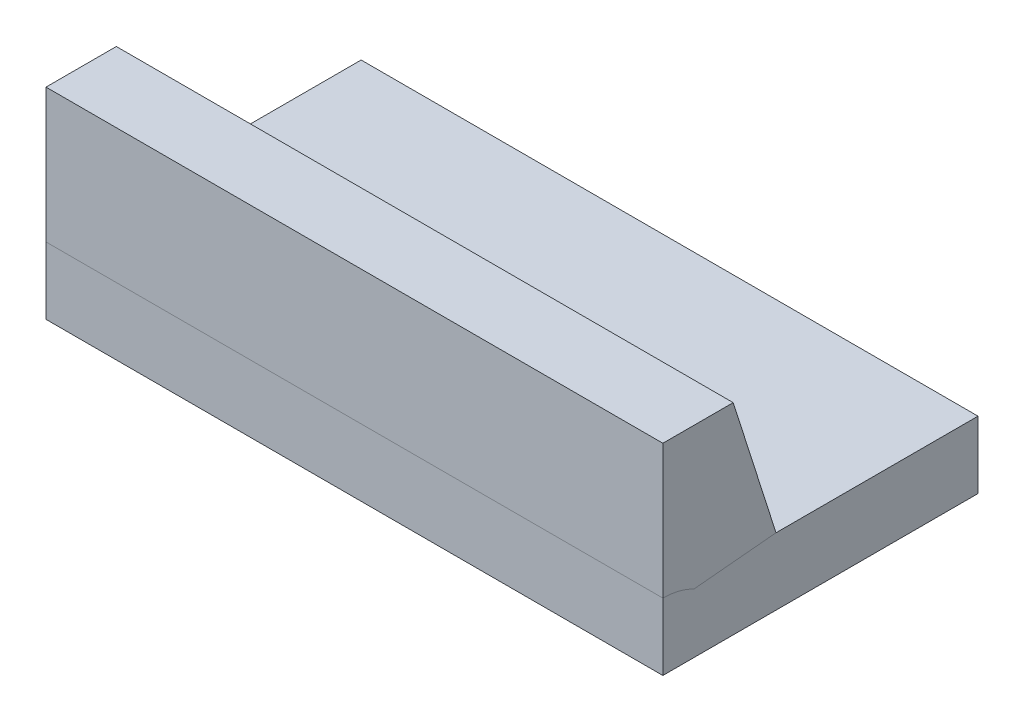
ISO-10303-21;
HEADER;
FILE_DESCRIPTION(('STEP AP214'),'2;1');
FILE_NAME('part.step','',(''),(''),'','','');
FILE_SCHEMA(('AUTOMOTIVE_DESIGN { 1 0 10303 214 1 1 1 1 }'));
ENDSEC;
DATA;
#1=APPLICATION_CONTEXT('core data for automotive mechanical design processes');
#2=APPLICATION_PROTOCOL_DEFINITION('international standard','automotive_design',2000,#1);
#3=PRODUCT_CONTEXT('',#1,'mechanical');
#4=PRODUCT('Part','Part','',(#3));
#5=PRODUCT_RELATED_PRODUCT_CATEGORY('part','',(#4));
#6=PRODUCT_DEFINITION_FORMATION('','',#4);
#7=PRODUCT_DEFINITION_CONTEXT('part definition',#1,'design');
#8=PRODUCT_DEFINITION('design','',#6,#7);
#9=PRODUCT_DEFINITION_SHAPE('','',#8);
#10=(LENGTH_UNIT() NAMED_UNIT(*) SI_UNIT(.MILLI.,.METRE.));
#11=(NAMED_UNIT(*) PLANE_ANGLE_UNIT() SI_UNIT($,.RADIAN.));
#12=(NAMED_UNIT(*) SI_UNIT($,.STERADIAN.) SOLID_ANGLE_UNIT());
#13=UNCERTAINTY_MEASURE_WITH_UNIT(LENGTH_MEASURE(1.E-05),#10,'distance_accuracy_value','');
#14=(GEOMETRIC_REPRESENTATION_CONTEXT(3) GLOBAL_UNCERTAINTY_ASSIGNED_CONTEXT((#13)) GLOBAL_UNIT_ASSIGNED_CONTEXT((#10,
#11,#12)) REPRESENTATION_CONTEXT('',''));
#15=CARTESIAN_POINT('',(0.,0.,0.));
#16=DIRECTION('',(0.,0.,1.));
#17=DIRECTION('',(1.,0.,0.));
#18=AXIS2_PLACEMENT_3D('',#15,#16,#17);
#19=CARTESIAN_POINT('',(22.0736196319018,15.,0.332030832005614));
#20=DIRECTION('',(1.,0.,0.));
#21=DIRECTION('',(0.,0.,-1.));
#22=AXIS2_PLACEMENT_3D('',#19,#20,#21);
#23=PLANE('',#22);
#24=DIRECTION('',(0.,0.,-1.));
#25=VECTOR('',#24,1.);
#26=CARTESIAN_POINT('',(22.0736196319018,5.,-12.7300613496932));
#27=LINE('',#26,#25);
#28=CARTESIAN_POINT('',(22.0736196319018,5.,2.33203083200561));
#29=VERTEX_POINT('',#28);
#30=CARTESIAN_POINT('',(22.0736196319018,5.,-12.7300613496932));
#31=VERTEX_POINT('',#30);
#32=EDGE_CURVE('E158',#29,#31,#27,.T.);
#33=ORIENTED_EDGE('',*,*,#32,.F.);
#34=DIRECTION('',(0.,-0.952604427614458,-0.3042117757243));
#35=VECTOR('',#34,1.);
#36=CARTESIAN_POINT('',(22.0736196319018,5.,2.33203083200561));
#37=LINE('',#36,#35);
#38=CARTESIAN_POINT('',(22.0736196319018,15.,5.52550513157523));
#39=VERTEX_POINT('',#38);
#40=EDGE_CURVE('E115',#39,#29,#37,.T.);
#41=ORIENTED_EDGE('',*,*,#40,.F.);
#42=DIRECTION('',(0.,0.,1.));
#43=VECTOR('',#42,1.);
#44=CARTESIAN_POINT('',(22.0736196319018,15.,0.332030832005614));
#45=LINE('',#44,#43);
#46=CARTESIAN_POINT('',(22.0736196319018,15.,10.7699386503067));
#47=VERTEX_POINT('',#46);
#48=EDGE_CURVE('E119',#39,#47,#45,.T.);
#49=ORIENTED_EDGE('',*,*,#48,.T.);
#50=DIRECTION('',(0.,-1.,0.));
#51=VECTOR('',#50,1.);
#52=CARTESIAN_POINT('',(22.0736196319018,15.,10.7699386503067));
#53=LINE('',#52,#51);
#54=CARTESIAN_POINT('',(22.0736196319018,5.,10.7699386503067));
#55=VERTEX_POINT('',#54);
#56=EDGE_CURVE('E124',#47,#55,#53,.T.);
#57=ORIENTED_EDGE('',*,*,#56,.T.);
#58=CARTESIAN_POINT('',(22.0736196319018,0.,10.7699386503068));
#59=DIRECTION('',(1.,0.,0.));
#60=DIRECTION('',(0.,0.,-1.));
#61=AXIS2_PLACEMENT_3D('',#58,#59,#60);
#62=CIRCLE('',#61,5.);
#63=CARTESIAN_POINT('',(22.0736196319018,0.,5.76993865030675));
#64=VERTEX_POINT('',#63);
#65=EDGE_CURVE('E138',#64,#55,#62,.T.);
#66=ORIENTED_EDGE('',*,*,#65,.F.);
#67=DIRECTION('',(0.,0.,-1.));
#68=VECTOR('',#67,1.);
#69=CARTESIAN_POINT('',(22.0736196319018,0.,-12.7300613496932));
#70=LINE('',#69,#68);
#71=CARTESIAN_POINT('',(22.0736196319018,0.,-12.7300613496932));
#72=VERTEX_POINT('',#71);
#73=EDGE_CURVE('E151',#64,#72,#70,.T.);
#74=ORIENTED_EDGE('',*,*,#73,.T.);
#75=DIRECTION('',(0.,-1.,0.));
#76=VECTOR('',#75,1.);
#77=CARTESIAN_POINT('',(22.0736196319018,5.,-12.7300613496932));
#78=LINE('',#77,#76);
#79=EDGE_CURVE('E140',#31,#72,#78,.T.);
#80=ORIENTED_EDGE('',*,*,#79,.F.);
#81=EDGE_LOOP('',(#33,#41,#49,#57,#66,#74,#80));
#82=FACE_BOUND('',#81,.T.);
#83=ADVANCED_FACE('F47',(#82),#23,.T.);
#84=CARTESIAN_POINT('',(-23.9263803680982,15.,0.332030832005614));
#85=DIRECTION('',(1.,0.,0.));
#86=DIRECTION('',(0.,0.,-1.));
#87=AXIS2_PLACEMENT_3D('',#84,#85,#86);
#88=PLANE('',#87);
#89=DIRECTION('',(0.,-0.952604427614458,-0.3042117757243));
#90=VECTOR('',#89,1.);
#91=CARTESIAN_POINT('',(-23.9263803680982,5.,2.33203083200563));
#92=LINE('',#91,#90);
#93=CARTESIAN_POINT('',(-23.9263803680982,15.,5.52550513157525));
#94=VERTEX_POINT('',#93);
#95=CARTESIAN_POINT('',(-23.9263803680982,5.,2.33203083200563));
#96=VERTEX_POINT('',#95);
#97=EDGE_CURVE('E106',#94,#96,#92,.T.);
#98=ORIENTED_EDGE('',*,*,#97,.T.);
#99=DIRECTION('',(0.,0.,1.));
#100=VECTOR('',#99,1.);
#101=CARTESIAN_POINT('',(-23.9263803680982,5.,-12.7300613496932));
#102=LINE('',#101,#100);
#103=CARTESIAN_POINT('',(-23.9263803680982,5.,-12.7300613496932));
#104=VERTEX_POINT('',#103);
#105=EDGE_CURVE('E150',#104,#96,#102,.T.);
#106=ORIENTED_EDGE('',*,*,#105,.F.);
#107=DIRECTION('',(0.,-1.,0.));
#108=VECTOR('',#107,1.);
#109=CARTESIAN_POINT('',(-23.9263803680982,5.,-12.7300613496932));
#110=LINE('',#109,#108);
#111=CARTESIAN_POINT('',(-23.9263803680982,0.,-12.7300613496932));
#112=VERTEX_POINT('',#111);
#113=EDGE_CURVE('E142',#104,#112,#110,.T.);
#114=ORIENTED_EDGE('',*,*,#113,.T.);
#115=DIRECTION('',(0.,0.,1.));
#116=VECTOR('',#115,1.);
#117=CARTESIAN_POINT('',(-23.9263803680982,0.,-12.7300613496932));
#118=LINE('',#117,#116);
#119=CARTESIAN_POINT('',(-23.9263803680982,0.,5.76993865030677));
#120=VERTEX_POINT('',#119);
#121=EDGE_CURVE('E153',#112,#120,#118,.T.);
#122=ORIENTED_EDGE('',*,*,#121,.T.);
#123=CARTESIAN_POINT('',(-23.9263803680982,0.,10.7699386503068));
#124=DIRECTION('',(1.,0.,0.));
#125=DIRECTION('',(0.,0.,-1.));
#126=AXIS2_PLACEMENT_3D('',#123,#124,#125);
#127=CIRCLE('',#126,5.);
#128=CARTESIAN_POINT('',(-23.9263803680982,5.,10.7699386503068));
#129=VERTEX_POINT('',#128);
#130=EDGE_CURVE('E61',#120,#129,#127,.T.);
#131=ORIENTED_EDGE('',*,*,#130,.T.);
#132=DIRECTION('',(0.,-1.,0.));
#133=VECTOR('',#132,1.);
#134=CARTESIAN_POINT('',(-23.9263803680982,15.,10.7699386503068));
#135=LINE('',#134,#133);
#136=CARTESIAN_POINT('',(-23.9263803680982,15.,10.7699386503068));
#137=VERTEX_POINT('',#136);
#138=EDGE_CURVE('E54',#137,#129,#135,.T.);
#139=ORIENTED_EDGE('',*,*,#138,.F.);
#140=DIRECTION('',(0.,0.,1.));
#141=VECTOR('',#140,1.);
#142=CARTESIAN_POINT('',(-23.9263803680982,15.,0.332030832005614));
#143=LINE('',#142,#141);
#144=EDGE_CURVE('E68',#94,#137,#143,.T.);
#145=ORIENTED_EDGE('',*,*,#144,.F.);
#146=EDGE_LOOP('',(#98,#106,#114,#122,#131,#139,#145));
#147=FACE_BOUND('',#146,.T.);
#148=ADVANCED_FACE('F121',(#147),#88,.F.);
#149=CARTESIAN_POINT('',(22.0736196319018,15.,10.7699386503067));
#150=DIRECTION('',(0.,0.,1.));
#151=DIRECTION('',(1.,0.,0.));
#152=AXIS2_PLACEMENT_3D('',#149,#150,#151);
#153=PLANE('',#152);
#154=DIRECTION('',(1.,0.,0.));
#155=VECTOR('',#154,1.);
#156=CARTESIAN_POINT('',(-23.9263803680982,5.,10.7699386503068));
#157=LINE('',#156,#155);
#158=EDGE_CURVE('E135',#55,#129,#157,.F.);
#159=ORIENTED_EDGE('',*,*,#158,.F.);
#160=ORIENTED_EDGE('',*,*,#56,.F.);
#161=DIRECTION('',(-1.,0.,0.));
#162=VECTOR('',#161,1.);
#163=CARTESIAN_POINT('',(22.0736196319018,15.,10.7699386503067));
#164=LINE('',#163,#162);
#165=EDGE_CURVE('E125',#47,#137,#164,.T.);
#166=ORIENTED_EDGE('',*,*,#165,.T.);
#167=ORIENTED_EDGE('',*,*,#138,.T.);
#168=EDGE_LOOP('',(#159,#160,#166,#167));
#169=FACE_BOUND('',#168,.T.);
#170=ADVANCED_FACE('F133',(#169),#153,.T.);
#171=CARTESIAN_POINT('',(0.,15.,0.));
#172=DIRECTION('',(0.,-1.,0.));
#173=DIRECTION('',(0.,0.,-1.));
#174=AXIS2_PLACEMENT_3D('',#171,#172,#173);
#175=PLANE('',#174);
#176=ORIENTED_EDGE('',*,*,#48,.F.);
#177=DIRECTION('',(1.,0.,0.));
#178=VECTOR('',#177,1.);
#179=CARTESIAN_POINT('',(-23.9263803680982,15.,5.52550513157525));
#180=LINE('',#179,#178);
#181=EDGE_CURVE('E109',#94,#39,#180,.T.);
#182=ORIENTED_EDGE('',*,*,#181,.F.);
#183=ORIENTED_EDGE('',*,*,#144,.T.);
#184=ORIENTED_EDGE('',*,*,#165,.F.);
#185=EDGE_LOOP('',(#176,#182,#183,#184));
#186=FACE_BOUND('',#185,.T.);
#187=ADVANCED_FACE('F118',(#186),#175,.F.);
#188=CARTESIAN_POINT('',(0.,5.,0.));
#189=DIRECTION('',(0.,1.,0.));
#190=DIRECTION('',(0.,0.,1.));
#191=AXIS2_PLACEMENT_3D('',#188,#189,#190);
#192=PLANE('',#191);
#193=CARTESIAN_POINT('',(10.0239592700189,5.,-4.31196916445347));
#194=DIRECTION('',(0.,1.,0.));
#195=DIRECTION('',(0.,0.,1.));
#196=AXIS2_PLACEMENT_3D('',#193,#194,#195);
#197=CIRCLE('',#196,2.);
#198=CARTESIAN_POINT('',(10.0239592700189,5.,-2.31196916445347));
#199=VERTEX_POINT('',#198);
#200=EDGE_CURVE('E156',#199,#199,#197,.T.);
#201=ORIENTED_EDGE('',*,*,#200,.F.);
#202=EDGE_LOOP('',(#201));
#203=FACE_BOUND('',#202,.T.);
#204=CARTESIAN_POINT('',(-11.9754119645762,5.,-4.4780632943706));
#205=DIRECTION('',(0.,1.,0.));
#206=DIRECTION('',(0.,0.,1.));
#207=AXIS2_PLACEMENT_3D('',#204,#205,#206);
#208=CIRCLE('',#207,2.00000000000001);
#209=CARTESIAN_POINT('',(-11.9754119645762,5.,-2.47806329437059));
#210=VERTEX_POINT('',#209);
#211=EDGE_CURVE('E163',#210,#210,#208,.T.);
#212=ORIENTED_EDGE('',*,*,#211,.F.);
#213=EDGE_LOOP('',(#212));
#214=FACE_BOUND('',#213,.T.);
#215=ORIENTED_EDGE('',*,*,#105,.T.);
#216=DIRECTION('',(1.,0.,0.));
#217=VECTOR('',#216,1.);
#218=CARTESIAN_POINT('',(-23.9263803680982,5.,2.33203083200563));
#219=LINE('',#218,#217);
#220=EDGE_CURVE('E112',#96,#29,#219,.T.);
#221=ORIENTED_EDGE('',*,*,#220,.T.);
#222=ORIENTED_EDGE('',*,*,#32,.T.);
#223=DIRECTION('',(-1.,0.,0.));
#224=VECTOR('',#223,1.);
#225=CARTESIAN_POINT('',(-23.9263803680982,5.,-12.7300613496932));
#226=LINE('',#225,#224);
#227=EDGE_CURVE('E147',#31,#104,#226,.T.);
#228=ORIENTED_EDGE('',*,*,#227,.T.);
#229=EDGE_LOOP('',(#215,#221,#222,#228));
#230=FACE_BOUND('',#229,.T.);
#231=ADVANCED_FACE('F177',(#203,#214,#230),#192,.T.);
#232=CARTESIAN_POINT('',(-23.9263803680982,5.,-12.7300613496932));
#233=DIRECTION('',(0.,0.,1.));
#234=DIRECTION('',(1.,0.,0.));
#235=AXIS2_PLACEMENT_3D('',#232,#233,#234);
#236=PLANE('',#235);
#237=DIRECTION('',(-1.,0.,0.));
#238=VECTOR('',#237,1.);
#239=CARTESIAN_POINT('',(-23.9263803680982,0.,-12.7300613496932));
#240=LINE('',#239,#238);
#241=EDGE_CURVE('E148',#72,#112,#240,.T.);
#242=ORIENTED_EDGE('',*,*,#241,.T.);
#243=ORIENTED_EDGE('',*,*,#113,.F.);
#244=ORIENTED_EDGE('',*,*,#227,.F.);
#245=ORIENTED_EDGE('',*,*,#79,.T.);
#246=EDGE_LOOP('',(#242,#243,#244,#245));
#247=FACE_BOUND('',#246,.T.);
#248=ADVANCED_FACE('F210',(#247),#236,.F.);
#249=CARTESIAN_POINT('',(0.,0.,0.));
#250=DIRECTION('',(0.,1.,0.));
#251=DIRECTION('',(0.,0.,1.));
#252=AXIS2_PLACEMENT_3D('',#249,#250,#251);
#253=PLANE('',#252);
#254=CARTESIAN_POINT('',(10.0239592700189,0.,-4.31196916445347));
#255=DIRECTION('',(0.,-1.,0.));
#256=DIRECTION('',(0.,0.,-1.));
#257=AXIS2_PLACEMENT_3D('',#254,#255,#256);
#258=CIRCLE('',#257,2.);
#259=CARTESIAN_POINT('',(10.0239592700189,0.,-6.31196916445347));
#260=VERTEX_POINT('',#259);
#261=EDGE_CURVE('E166',#260,#260,#258,.T.);
#262=ORIENTED_EDGE('',*,*,#261,.F.);
#263=EDGE_LOOP('',(#262));
#264=FACE_BOUND('',#263,.T.);
#265=CARTESIAN_POINT('',(-11.9754119645762,0.,-4.4780632943706));
#266=DIRECTION('',(0.,-1.,0.));
#267=DIRECTION('',(0.,0.,-1.));
#268=AXIS2_PLACEMENT_3D('',#265,#266,#267);
#269=CIRCLE('',#268,2.00000000000001);
#270=CARTESIAN_POINT('',(-11.9754119645762,0.,-6.4780632943706));
#271=VERTEX_POINT('',#270);
#272=EDGE_CURVE('E167',#271,#271,#269,.T.);
#273=ORIENTED_EDGE('',*,*,#272,.F.);
#274=EDGE_LOOP('',(#273));
#275=FACE_BOUND('',#274,.T.);
#276=ORIENTED_EDGE('',*,*,#73,.F.);
#277=DIRECTION('',(1.,0.,0.));
#278=VECTOR('',#277,1.);
#279=CARTESIAN_POINT('',(-23.9263803680982,0.,5.76993865030677));
#280=LINE('',#279,#278);
#281=EDGE_CURVE('E12',#64,#120,#280,.F.);
#282=ORIENTED_EDGE('',*,*,#281,.T.);
#283=ORIENTED_EDGE('',*,*,#121,.F.);
#284=ORIENTED_EDGE('',*,*,#241,.F.);
#285=EDGE_LOOP('',(#276,#282,#283,#284));
#286=FACE_BOUND('',#285,.T.);
#287=ADVANCED_FACE('F185',(#264,#275,#286),#253,.F.);
#288=CARTESIAN_POINT('',(-11.9754119645762,10.,-4.4780632943706));
#289=DIRECTION('',(0.,-1.,0.));
#290=DIRECTION('',(0.,0.,-1.));
#291=AXIS2_PLACEMENT_3D('',#288,#289,#290);
#292=CYLINDRICAL_SURFACE('',#291,2.00000000000001);
#293=ORIENTED_EDGE('',*,*,#211,.T.);
#294=EDGE_LOOP('',(#293));
#295=FACE_BOUND('',#294,.T.);
#296=ORIENTED_EDGE('',*,*,#272,.T.);
#297=EDGE_LOOP('',(#296));
#298=FACE_BOUND('',#297,.T.);
#299=ADVANCED_FACE('F195',(#295,#298),#292,.F.);
#300=CARTESIAN_POINT('',(10.0239592700189,10.,-4.31196916445347));
#301=DIRECTION('',(0.,-1.,0.));
#302=DIRECTION('',(0.,0.,-1.));
#303=AXIS2_PLACEMENT_3D('',#300,#301,#302);
#304=CYLINDRICAL_SURFACE('',#303,2.);
#305=ORIENTED_EDGE('',*,*,#200,.T.);
#306=EDGE_LOOP('',(#305));
#307=FACE_BOUND('',#306,.T.);
#308=ORIENTED_EDGE('',*,*,#261,.T.);
#309=EDGE_LOOP('',(#308));
#310=FACE_BOUND('',#309,.T.);
#311=ADVANCED_FACE('F188',(#307,#310),#304,.F.);
#312=CARTESIAN_POINT('',(-23.9263803680982,0.,10.7699386503068));
#313=DIRECTION('',(1.,0.,0.));
#314=DIRECTION('',(0.,0.,-1.));
#315=AXIS2_PLACEMENT_3D('',#312,#313,#314);
#316=CYLINDRICAL_SURFACE('',#315,5.);
#317=ORIENTED_EDGE('',*,*,#158,.T.);
#318=ORIENTED_EDGE('',*,*,#130,.F.);
#319=ORIENTED_EDGE('',*,*,#281,.F.);
#320=ORIENTED_EDGE('',*,*,#65,.T.);
#321=EDGE_LOOP('',(#317,#318,#319,#320));
#322=FACE_BOUND('',#321,.T.);
#323=ADVANCED_FACE('F186',(#322),#316,.F.);
#324=CARTESIAN_POINT('',(-23.9263803680982,5.,2.33203083200563));
#325=DIRECTION('',(0.,-0.304211775724299,0.952604427614458));
#326=DIRECTION('',(0.,-0.952604427614458,-0.3042117757243));
#327=AXIS2_PLACEMENT_3D('',#324,#325,#326);
#328=PLANE('',#327);
#329=ORIENTED_EDGE('',*,*,#40,.T.);
#330=ORIENTED_EDGE('',*,*,#220,.F.);
#331=ORIENTED_EDGE('',*,*,#97,.F.);
#332=ORIENTED_EDGE('',*,*,#181,.T.);
#333=EDGE_LOOP('',(#329,#330,#331,#332));
#334=FACE_BOUND('',#333,.T.);
#335=ADVANCED_FACE('F108',(#334),#328,.F.);
#336=CLOSED_SHELL('',(#83,#148,#170,#187,#231,#248,#287,#299,#311,#323,#335));
#337=MANIFOLD_SOLID_BREP('B2',#336);
#338=CARTESIAN_POINT('',(-23.9263803680982,5.,-12.7300613496932));
#339=DIRECTION('',(1.,0.,0.));
#340=DIRECTION('',(0.,0.,-1.));
#341=AXIS2_PLACEMENT_3D('',#338,#339,#340);
#342=PLANE('',#341);
#343=DIRECTION('',(0.,0.,1.));
#344=VECTOR('',#343,1.);
#345=CARTESIAN_POINT('',(-23.9263803680982,0.,-12.7300613496932));
#346=LINE('',#345,#344);
#347=CARTESIAN_POINT('',(-23.9263803680982,0.,-12.7300613496932));
#348=VERTEX_POINT('',#347);
#349=CARTESIAN_POINT('',(-23.9263803680982,0.,10.7699386503068));
#350=VERTEX_POINT('',#349);
#351=EDGE_CURVE('E365',#348,#350,#346,.T.);
#352=ORIENTED_EDGE('',*,*,#351,.T.);
#353=DIRECTION('',(0.,-1.,0.));
#354=VECTOR('',#353,1.);
#355=CARTESIAN_POINT('',(-23.9263803680982,5.,10.7699386503068));
#356=LINE('',#355,#354);
#357=CARTESIAN_POINT('',(-23.9263803680982,5.,10.7699386503068));
#358=VERTEX_POINT('',#357);
#359=EDGE_CURVE('E45',#358,#350,#356,.T.);
#360=ORIENTED_EDGE('',*,*,#359,.F.);
#361=DIRECTION('',(0.,0.,1.));
#362=VECTOR('',#361,1.);
#363=CARTESIAN_POINT('',(-23.9263803680982,5.,-12.7300613496932));
#364=LINE('',#363,#362);
#365=CARTESIAN_POINT('',(-23.9263803680982,5.,-12.7300613496932));
#366=VERTEX_POINT('',#365);
#367=EDGE_CURVE('E353',#366,#358,#364,.T.);
#368=ORIENTED_EDGE('',*,*,#367,.F.);
#369=DIRECTION('',(0.,-1.,0.));
#370=VECTOR('',#369,1.);
#371=CARTESIAN_POINT('',(-23.9263803680982,5.,-12.7300613496932));
#372=LINE('',#371,#370);
#373=EDGE_CURVE('E361',#366,#348,#372,.T.);
#374=ORIENTED_EDGE('',*,*,#373,.T.);
#375=EDGE_LOOP('',(#352,#360,#368,#374));
#376=FACE_BOUND('',#375,.T.);
#377=ADVANCED_FACE('F302',(#376),#342,.F.);
#378=CARTESIAN_POINT('',(-23.9263803680982,5.,10.7699386503068));
#379=DIRECTION('',(0.,0.,-1.));
#380=DIRECTION('',(-1.,0.,0.));
#381=AXIS2_PLACEMENT_3D('',#378,#379,#380);
#382=PLANE('',#381);
#383=DIRECTION('',(1.,0.,0.));
#384=VECTOR('',#383,1.);
#385=CARTESIAN_POINT('',(-23.9263803680982,0.,10.7699386503068));
#386=LINE('',#385,#384);
#387=CARTESIAN_POINT('',(22.0736196319018,0.,10.7699386503068));
#388=VERTEX_POINT('',#387);
#389=EDGE_CURVE('E357',#350,#388,#386,.T.);
#390=ORIENTED_EDGE('',*,*,#389,.T.);
#391=DIRECTION('',(0.,-1.,0.));
#392=VECTOR('',#391,1.);
#393=CARTESIAN_POINT('',(22.0736196319018,5.,10.7699386503068));
#394=LINE('',#393,#392);
#395=CARTESIAN_POINT('',(22.0736196319018,5.,10.7699386503068));
#396=VERTEX_POINT('',#395);
#397=EDGE_CURVE('E310',#396,#388,#394,.T.);
#398=ORIENTED_EDGE('',*,*,#397,.F.);
#399=DIRECTION('',(1.,0.,0.));
#400=VECTOR('',#399,1.);
#401=CARTESIAN_POINT('',(-23.9263803680982,5.,10.7699386503068));
#402=LINE('',#401,#400);
#403=EDGE_CURVE('E348',#358,#396,#402,.T.);
#404=ORIENTED_EDGE('',*,*,#403,.F.);
#405=ORIENTED_EDGE('',*,*,#359,.T.);
#406=EDGE_LOOP('',(#390,#398,#404,#405));
#407=FACE_BOUND('',#406,.T.);
#408=ADVANCED_FACE('F356',(#407),#382,.F.);
#409=CARTESIAN_POINT('',(22.0736196319018,5.,-12.7300613496932));
#410=DIRECTION('',(-1.,0.,0.));
#411=DIRECTION('',(0.,0.,1.));
#412=AXIS2_PLACEMENT_3D('',#409,#410,#411);
#413=PLANE('',#412);
#414=DIRECTION('',(0.,0.,-1.));
#415=VECTOR('',#414,1.);
#416=CARTESIAN_POINT('',(22.0736196319018,0.,-12.7300613496932));
#417=LINE('',#416,#415);
#418=CARTESIAN_POINT('',(22.0736196319018,0.,-12.7300613496932));
#419=VERTEX_POINT('',#418);
#420=EDGE_CURVE('E335',#388,#419,#417,.T.);
#421=ORIENTED_EDGE('',*,*,#420,.T.);
#422=DIRECTION('',(0.,-1.,0.));
#423=VECTOR('',#422,1.);
#424=CARTESIAN_POINT('',(22.0736196319018,5.,-12.7300613496932));
#425=LINE('',#424,#423);
#426=CARTESIAN_POINT('',(22.0736196319018,5.,-12.7300613496932));
#427=VERTEX_POINT('',#426);
#428=EDGE_CURVE('E358',#427,#419,#425,.T.);
#429=ORIENTED_EDGE('',*,*,#428,.F.);
#430=DIRECTION('',(0.,0.,-1.));
#431=VECTOR('',#430,1.);
#432=CARTESIAN_POINT('',(22.0736196319018,5.,-12.7300613496932));
#433=LINE('',#432,#431);
#434=EDGE_CURVE('E351',#396,#427,#433,.T.);
#435=ORIENTED_EDGE('',*,*,#434,.F.);
#436=ORIENTED_EDGE('',*,*,#397,.T.);
#437=EDGE_LOOP('',(#421,#429,#435,#436));
#438=FACE_BOUND('',#437,.T.);
#439=ADVANCED_FACE('F359',(#438),#413,.F.);
#440=CARTESIAN_POINT('',(-23.9263803680982,5.,-12.7300613496932));
#441=DIRECTION('',(0.,0.,1.));
#442=DIRECTION('',(1.,0.,0.));
#443=AXIS2_PLACEMENT_3D('',#440,#441,#442);
#444=PLANE('',#443);
#445=DIRECTION('',(-1.,0.,0.));
#446=VECTOR('',#445,1.);
#447=CARTESIAN_POINT('',(-23.9263803680982,0.,-12.7300613496932));
#448=LINE('',#447,#446);
#449=EDGE_CURVE('E341',#419,#348,#448,.T.);
#450=ORIENTED_EDGE('',*,*,#449,.T.);
#451=ORIENTED_EDGE('',*,*,#373,.F.);
#452=DIRECTION('',(-1.,0.,0.));
#453=VECTOR('',#452,1.);
#454=CARTESIAN_POINT('',(-23.9263803680982,5.,-12.7300613496932));
#455=LINE('',#454,#453);
#456=EDGE_CURVE('E318',#427,#366,#455,.T.);
#457=ORIENTED_EDGE('',*,*,#456,.F.);
#458=ORIENTED_EDGE('',*,*,#428,.T.);
#459=EDGE_LOOP('',(#450,#451,#457,#458));
#460=FACE_BOUND('',#459,.T.);
#461=ADVANCED_FACE('F372',(#460),#444,.F.);
#462=CARTESIAN_POINT('',(0.,5.,0.));
#463=DIRECTION('',(0.,1.,0.));
#464=DIRECTION('',(0.,0.,1.));
#465=AXIS2_PLACEMENT_3D('',#462,#463,#464);
#466=PLANE('',#465);
#467=ORIENTED_EDGE('',*,*,#367,.T.);
#468=ORIENTED_EDGE('',*,*,#403,.T.);
#469=ORIENTED_EDGE('',*,*,#434,.T.);
#470=ORIENTED_EDGE('',*,*,#456,.T.);
#471=EDGE_LOOP('',(#467,#468,#469,#470));
#472=FACE_BOUND('',#471,.T.);
#473=ADVANCED_FACE('F349',(#472),#466,.T.);
#474=CARTESIAN_POINT('',(0.,0.,0.));
#475=DIRECTION('',(0.,1.,0.));
#476=DIRECTION('',(0.,0.,1.));
#477=AXIS2_PLACEMENT_3D('',#474,#475,#476);
#478=PLANE('',#477);
#479=ORIENTED_EDGE('',*,*,#351,.F.);
#480=ORIENTED_EDGE('',*,*,#449,.F.);
#481=ORIENTED_EDGE('',*,*,#420,.F.);
#482=ORIENTED_EDGE('',*,*,#389,.F.);
#483=EDGE_LOOP('',(#479,#480,#481,#482));
#484=FACE_BOUND('',#483,.T.);
#485=ADVANCED_FACE('F375',(#484),#478,.F.);
#486=CLOSED_SHELL('',(#377,#408,#439,#461,#473,#485));
#487=MANIFOLD_SOLID_BREP('B6_NOT_SHOWN',#486);
#488=ADVANCED_BREP_SHAPE_REPRESENTATION('',(#18,#337,#487),#14);
#489=SHAPE_DEFINITION_REPRESENTATION(#9,#488);
ENDSEC;
END-ISO-10303-21;
